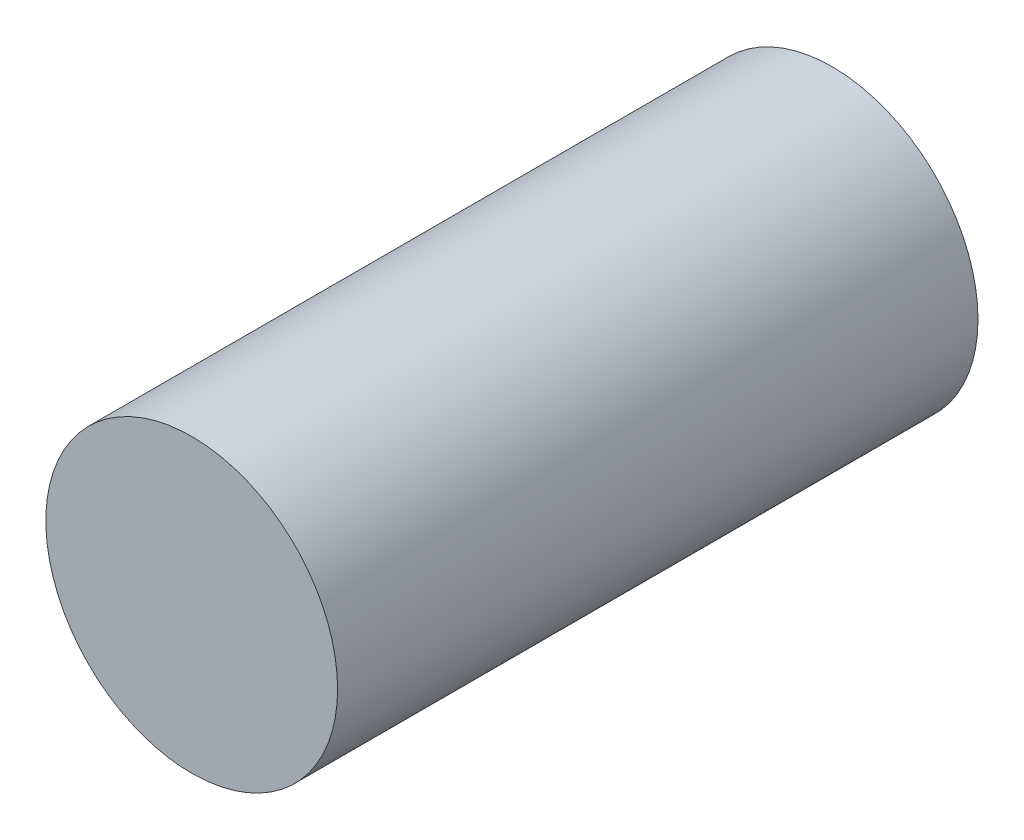
ISO-10303-21;
HEADER;
FILE_DESCRIPTION(('STEP AP214'),'2;1');
FILE_NAME('part.step','',(''),(''),'','','');
FILE_SCHEMA(('AUTOMOTIVE_DESIGN { 1 0 10303 214 1 1 1 1 }'));
ENDSEC;
DATA;
#1=APPLICATION_CONTEXT('core data for automotive mechanical design processes');
#2=APPLICATION_PROTOCOL_DEFINITION('international standard','automotive_design',2000,#1);
#3=PRODUCT_CONTEXT('',#1,'mechanical');
#4=PRODUCT('Part','Part','',(#3));
#5=PRODUCT_RELATED_PRODUCT_CATEGORY('part','',(#4));
#6=PRODUCT_DEFINITION_FORMATION('','',#4);
#7=PRODUCT_DEFINITION_CONTEXT('part definition',#1,'design');
#8=PRODUCT_DEFINITION('design','',#6,#7);
#9=PRODUCT_DEFINITION_SHAPE('','',#8);
#10=(LENGTH_UNIT() NAMED_UNIT(*) SI_UNIT(.MILLI.,.METRE.));
#11=(NAMED_UNIT(*) PLANE_ANGLE_UNIT() SI_UNIT($,.RADIAN.));
#12=(NAMED_UNIT(*) SI_UNIT($,.STERADIAN.) SOLID_ANGLE_UNIT());
#13=UNCERTAINTY_MEASURE_WITH_UNIT(LENGTH_MEASURE(1.E-05),#10,'distance_accuracy_value','');
#14=(GEOMETRIC_REPRESENTATION_CONTEXT(3) GLOBAL_UNCERTAINTY_ASSIGNED_CONTEXT((#13)) GLOBAL_UNIT_ASSIGNED_CONTEXT((#10,
#11,#12)) REPRESENTATION_CONTEXT('',''));
#15=CARTESIAN_POINT('',(0.,0.,0.));
#16=DIRECTION('',(0.,0.,1.));
#17=DIRECTION('',(1.,0.,0.));
#18=AXIS2_PLACEMENT_3D('',#15,#16,#17);
#19=CARTESIAN_POINT('',(2.54,1.27,0.1));
#20=DIRECTION('',(0.,0.,1.));
#21=DIRECTION('',(1.,0.,0.));
#22=AXIS2_PLACEMENT_3D('',#19,#20,#21);
#23=PLANE('',#22);
#24=CARTESIAN_POINT('',(2.54,1.27,0.1));
#25=DIRECTION('',(0.,0.,1.));
#26=DIRECTION('',(1.,0.,0.));
#27=AXIS2_PLACEMENT_3D('',#24,#25,#26);
#28=CIRCLE('',#27,0.41);
#29=CARTESIAN_POINT('',(2.95,1.27,0.1));
#30=VERTEX_POINT('',#29);
#31=EDGE_CURVE('E17',#30,#30,#28,.F.);
#32=ORIENTED_EDGE('',*,*,#31,.F.);
#33=EDGE_LOOP('',(#32));
#34=FACE_BOUND('',#33,.T.);
#35=ADVANCED_FACE('F14',(#34),#23,.T.);
#36=CARTESIAN_POINT('',(2.54,1.27,-1.7));
#37=DIRECTION('',(0.,0.,1.));
#38=DIRECTION('',(1.,0.,0.));
#39=AXIS2_PLACEMENT_3D('',#36,#37,#38);
#40=PLANE('',#39);
#41=CARTESIAN_POINT('',(2.54,1.27,-1.7));
#42=DIRECTION('',(0.,0.,1.));
#43=DIRECTION('',(1.,0.,0.));
#44=AXIS2_PLACEMENT_3D('',#41,#42,#43);
#45=CIRCLE('',#44,0.41);
#46=CARTESIAN_POINT('',(2.95,1.27,-1.7));
#47=VERTEX_POINT('',#46);
#48=EDGE_CURVE('E10',#47,#47,#45,.T.);
#49=ORIENTED_EDGE('',*,*,#48,.F.);
#50=EDGE_LOOP('',(#49));
#51=FACE_BOUND('',#50,.T.);
#52=ADVANCED_FACE('F29',(#51),#40,.F.);
#53=CARTESIAN_POINT('',(2.54,1.27,-1.7));
#54=DIRECTION('',(0.,0.,1.));
#55=DIRECTION('',(1.,0.,0.));
#56=AXIS2_PLACEMENT_3D('',#53,#54,#55);
#57=CYLINDRICAL_SURFACE('',#56,0.41);
#58=ORIENTED_EDGE('',*,*,#48,.T.);
#59=EDGE_LOOP('',(#58));
#60=FACE_BOUND('',#59,.T.);
#61=ORIENTED_EDGE('',*,*,#31,.T.);
#62=EDGE_LOOP('',(#61));
#63=FACE_BOUND('',#62,.T.);
#64=ADVANCED_FACE('F26',(#60,#63),#57,.T.);
#65=CLOSED_SHELL('',(#35,#52,#64));
#66=MANIFOLD_SOLID_BREP('B1',#65);
#67=ADVANCED_BREP_SHAPE_REPRESENTATION('',(#18,#66),#14);
#68=SHAPE_DEFINITION_REPRESENTATION(#9,#67);
ENDSEC;
END-ISO-10303-21;
